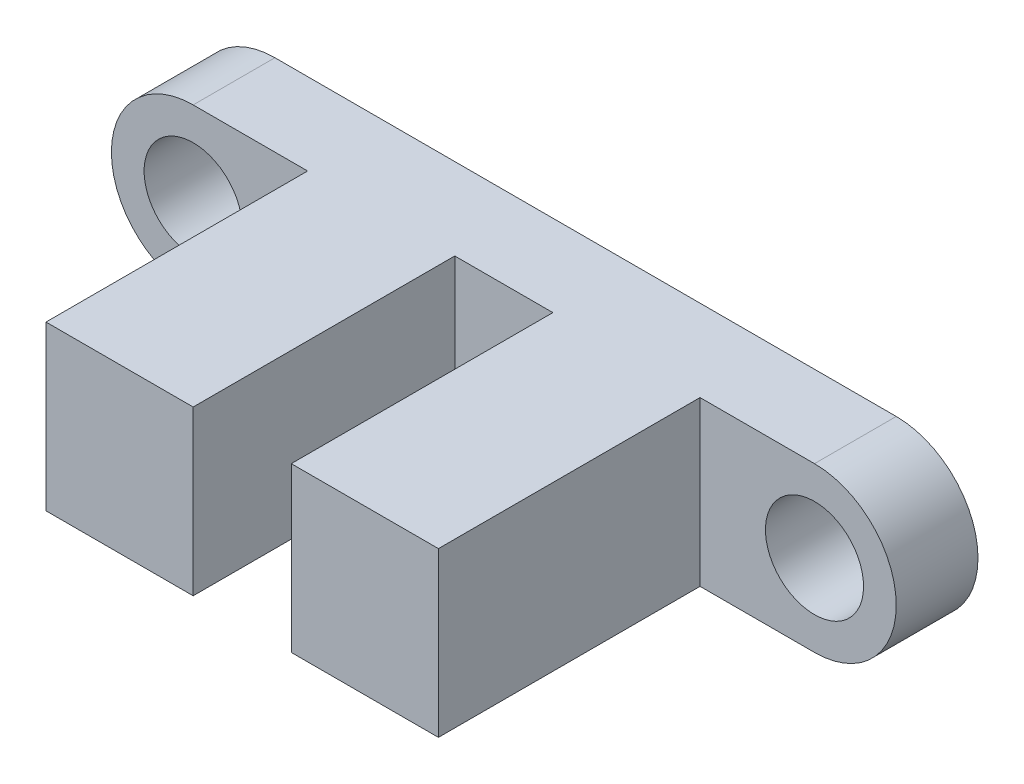
ISO-10303-21;
HEADER;
FILE_DESCRIPTION(('STEP AP214'),'2;1');
FILE_NAME('part.step','',(''),(''),'','','');
FILE_SCHEMA(('AUTOMOTIVE_DESIGN { 1 0 10303 214 1 1 1 1 }'));
ENDSEC;
DATA;
#1=APPLICATION_CONTEXT('core data for automotive mechanical design processes');
#2=APPLICATION_PROTOCOL_DEFINITION('international standard','automotive_design',2000,#1);
#3=PRODUCT_CONTEXT('',#1,'mechanical');
#4=PRODUCT('Part','Part','',(#3));
#5=PRODUCT_RELATED_PRODUCT_CATEGORY('part','',(#4));
#6=PRODUCT_DEFINITION_FORMATION('','',#4);
#7=PRODUCT_DEFINITION_CONTEXT('part definition',#1,'design');
#8=PRODUCT_DEFINITION('design','',#6,#7);
#9=PRODUCT_DEFINITION_SHAPE('','',#8);
#10=(LENGTH_UNIT() NAMED_UNIT(*) SI_UNIT(.MILLI.,.METRE.));
#11=(NAMED_UNIT(*) PLANE_ANGLE_UNIT() SI_UNIT($,.RADIAN.));
#12=(NAMED_UNIT(*) SI_UNIT($,.STERADIAN.) SOLID_ANGLE_UNIT());
#13=UNCERTAINTY_MEASURE_WITH_UNIT(LENGTH_MEASURE(1.E-05),#10,'distance_accuracy_value','');
#14=(GEOMETRIC_REPRESENTATION_CONTEXT(3) GLOBAL_UNCERTAINTY_ASSIGNED_CONTEXT((#13)) GLOBAL_UNIT_ASSIGNED_CONTEXT((#10,
#11,#12)) REPRESENTATION_CONTEXT('',''));
#15=CARTESIAN_POINT('',(0.,0.,0.));
#16=DIRECTION('',(0.,0.,1.));
#17=DIRECTION('',(1.,0.,0.));
#18=AXIS2_PLACEMENT_3D('',#15,#16,#17);
#19=CARTESIAN_POINT('',(0.,0.,2.5));
#20=DIRECTION('',(0.,0.,1.));
#21=DIRECTION('',(1.,0.,0.));
#22=AXIS2_PLACEMENT_3D('',#19,#20,#21);
#23=PLANE('',#22);
#24=DIRECTION('',(0.,1.,0.));
#25=VECTOR('',#24,1.);
#26=CARTESIAN_POINT('',(8.,2.5,2.5));
#27=LINE('',#26,#25);
#28=CARTESIAN_POINT('',(8.,-2.5,2.5));
#29=VERTEX_POINT('',#28);
#30=CARTESIAN_POINT('',(8.,2.5,2.5));
#31=VERTEX_POINT('',#30);
#32=EDGE_CURVE('E151',#29,#31,#27,.T.);
#33=ORIENTED_EDGE('',*,*,#32,.F.);
#34=DIRECTION('',(1.,0.,0.));
#35=VECTOR('',#34,1.);
#36=CARTESIAN_POINT('',(0.,-2.5,2.5));
#37=LINE('',#36,#35);
#38=CARTESIAN_POINT('',(11.,-2.5,2.5));
#39=VERTEX_POINT('',#38);
#40=EDGE_CURVE('E205',#29,#39,#37,.T.);
#41=ORIENTED_EDGE('',*,*,#40,.T.);
#42=DIRECTION('',(0.,-1.,0.));
#43=VECTOR('',#42,1.);
#44=CARTESIAN_POINT('',(11.,2.5,2.5));
#45=LINE('',#44,#43);
#46=CARTESIAN_POINT('',(11.,2.5,2.5));
#47=VERTEX_POINT('',#46);
#48=EDGE_CURVE('E174',#47,#39,#45,.T.);
#49=ORIENTED_EDGE('',*,*,#48,.F.);
#50=DIRECTION('',(-1.,0.,0.));
#51=VECTOR('',#50,1.);
#52=CARTESIAN_POINT('',(0.,2.5,2.5));
#53=LINE('',#52,#51);
#54=EDGE_CURVE('E64',#47,#31,#53,.T.);
#55=ORIENTED_EDGE('',*,*,#54,.T.);
#56=EDGE_LOOP('',(#33,#41,#49,#55));
#57=FACE_BOUND('',#56,.T.);
#58=ADVANCED_FACE('F41',(#57),#23,.T.);
#59=DIRECTION('',(0.,1.,0.));
#60=VECTOR('',#59,1.);
#61=CARTESIAN_POINT('',(15.5,2.5,2.5));
#62=LINE('',#61,#60);
#63=CARTESIAN_POINT('',(15.5,-2.5,2.5));
#64=VERTEX_POINT('',#63);
#65=CARTESIAN_POINT('',(15.5,2.5,2.5));
#66=VERTEX_POINT('',#65);
#67=EDGE_CURVE('E177',#64,#66,#62,.T.);
#68=ORIENTED_EDGE('',*,*,#67,.F.);
#69=CARTESIAN_POINT('',(19.,-2.5,2.5));
#70=VERTEX_POINT('',#69);
#71=EDGE_CURVE('E200',#64,#70,#37,.T.);
#72=ORIENTED_EDGE('',*,*,#71,.T.);
#73=CARTESIAN_POINT('',(19.,0.,2.5));
#74=DIRECTION('',(0.,0.,1.));
#75=DIRECTION('',(-1.,0.,0.));
#76=AXIS2_PLACEMENT_3D('',#73,#74,#75);
#77=CIRCLE('',#76,2.5);
#78=CARTESIAN_POINT('',(19.,2.5,2.5));
#79=VERTEX_POINT('',#78);
#80=EDGE_CURVE('E204',#70,#79,#77,.T.);
#81=ORIENTED_EDGE('',*,*,#80,.T.);
#82=EDGE_CURVE('E208',#79,#66,#53,.T.);
#83=ORIENTED_EDGE('',*,*,#82,.T.);
#84=EDGE_LOOP('',(#68,#72,#81,#83));
#85=FACE_BOUND('',#84,.T.);
#86=CARTESIAN_POINT('',(19.,0.,2.5));
#87=DIRECTION('',(0.,0.,1.));
#88=DIRECTION('',(1.,0.,0.));
#89=AXIS2_PLACEMENT_3D('',#86,#87,#88);
#90=CIRCLE('',#89,1.5);
#91=CARTESIAN_POINT('',(20.5,0.,2.5));
#92=VERTEX_POINT('',#91);
#93=EDGE_CURVE('E155',#92,#92,#90,.T.);
#94=ORIENTED_EDGE('',*,*,#93,.F.);
#95=EDGE_LOOP('',(#94));
#96=FACE_BOUND('',#95,.T.);
#97=ADVANCED_FACE('F258',(#85,#96),#23,.T.);
#98=DIRECTION('',(0.,-1.,0.));
#99=VECTOR('',#98,1.);
#100=CARTESIAN_POINT('',(3.5,2.5,2.5));
#101=LINE('',#100,#99);
#102=CARTESIAN_POINT('',(3.5,2.5,2.5));
#103=VERTEX_POINT('',#102);
#104=CARTESIAN_POINT('',(3.5,-2.5,2.5));
#105=VERTEX_POINT('',#104);
#106=EDGE_CURVE('E56',#103,#105,#101,.T.);
#107=ORIENTED_EDGE('',*,*,#106,.F.);
#108=CARTESIAN_POINT('',(0.,2.5,2.5));
#109=VERTEX_POINT('',#108);
#110=EDGE_CURVE('E207',#103,#109,#53,.T.);
#111=ORIENTED_EDGE('',*,*,#110,.T.);
#112=CARTESIAN_POINT('',(0.,0.,2.5));
#113=DIRECTION('',(0.,0.,1.));
#114=DIRECTION('',(1.,0.,0.));
#115=AXIS2_PLACEMENT_3D('',#112,#113,#114);
#116=CIRCLE('',#115,2.5);
#117=CARTESIAN_POINT('',(0.,-2.5,2.5));
#118=VERTEX_POINT('',#117);
#119=EDGE_CURVE('E197',#109,#118,#116,.T.);
#120=ORIENTED_EDGE('',*,*,#119,.T.);
#121=EDGE_CURVE('E202',#118,#105,#37,.T.);
#122=ORIENTED_EDGE('',*,*,#121,.T.);
#123=EDGE_LOOP('',(#107,#111,#120,#122));
#124=FACE_BOUND('',#123,.T.);
#125=CARTESIAN_POINT('',(0.,0.,2.5));
#126=DIRECTION('',(0.,0.,1.));
#127=DIRECTION('',(1.,0.,0.));
#128=AXIS2_PLACEMENT_3D('',#125,#126,#127);
#129=CIRCLE('',#128,1.5);
#130=CARTESIAN_POINT('',(1.5,0.,2.5));
#131=VERTEX_POINT('',#130);
#132=EDGE_CURVE('E191',#131,#131,#129,.T.);
#133=ORIENTED_EDGE('',*,*,#132,.F.);
#134=EDGE_LOOP('',(#133));
#135=FACE_BOUND('',#134,.T.);
#136=ADVANCED_FACE('F241',(#124,#135),#23,.T.);
#137=CARTESIAN_POINT('',(0.,0.,0.));
#138=DIRECTION('',(0.,0.,1.));
#139=DIRECTION('',(1.,0.,0.));
#140=AXIS2_PLACEMENT_3D('',#137,#138,#139);
#141=PLANE('',#140);
#142=CARTESIAN_POINT('',(0.,0.,0.));
#143=DIRECTION('',(0.,0.,1.));
#144=DIRECTION('',(1.,0.,0.));
#145=AXIS2_PLACEMENT_3D('',#142,#143,#144);
#146=CIRCLE('',#145,2.5);
#147=CARTESIAN_POINT('',(0.,2.5,0.));
#148=VERTEX_POINT('',#147);
#149=CARTESIAN_POINT('',(0.,-2.5,0.));
#150=VERTEX_POINT('',#149);
#151=EDGE_CURVE('E194',#148,#150,#146,.T.);
#152=ORIENTED_EDGE('',*,*,#151,.F.);
#153=DIRECTION('',(-1.,0.,0.));
#154=VECTOR('',#153,1.);
#155=CARTESIAN_POINT('',(0.,2.5,0.));
#156=LINE('',#155,#154);
#157=CARTESIAN_POINT('',(19.,2.5,0.));
#158=VERTEX_POINT('',#157);
#159=EDGE_CURVE('E201',#158,#148,#156,.T.);
#160=ORIENTED_EDGE('',*,*,#159,.F.);
#161=CARTESIAN_POINT('',(19.,0.,0.));
#162=DIRECTION('',(0.,0.,1.));
#163=DIRECTION('',(-1.,0.,0.));
#164=AXIS2_PLACEMENT_3D('',#161,#162,#163);
#165=CIRCLE('',#164,2.5);
#166=CARTESIAN_POINT('',(19.,-2.5,0.));
#167=VERTEX_POINT('',#166);
#168=EDGE_CURVE('E215',#167,#158,#165,.T.);
#169=ORIENTED_EDGE('',*,*,#168,.F.);
#170=DIRECTION('',(1.,0.,0.));
#171=VECTOR('',#170,1.);
#172=CARTESIAN_POINT('',(0.,-2.5,0.));
#173=LINE('',#172,#171);
#174=EDGE_CURVE('E213',#150,#167,#173,.T.);
#175=ORIENTED_EDGE('',*,*,#174,.F.);
#176=EDGE_LOOP('',(#152,#160,#169,#175));
#177=FACE_BOUND('',#176,.T.);
#178=CARTESIAN_POINT('',(0.,0.,0.));
#179=DIRECTION('',(0.,0.,1.));
#180=DIRECTION('',(1.,0.,0.));
#181=AXIS2_PLACEMENT_3D('',#178,#179,#180);
#182=CIRCLE('',#181,1.5);
#183=CARTESIAN_POINT('',(1.5,0.,0.));
#184=VERTEX_POINT('',#183);
#185=EDGE_CURVE('E189',#184,#184,#182,.T.);
#186=ORIENTED_EDGE('',*,*,#185,.T.);
#187=EDGE_LOOP('',(#186));
#188=FACE_BOUND('',#187,.T.);
#189=CARTESIAN_POINT('',(19.,0.,0.));
#190=DIRECTION('',(0.,0.,1.));
#191=DIRECTION('',(1.,0.,0.));
#192=AXIS2_PLACEMENT_3D('',#189,#190,#191);
#193=CIRCLE('',#192,1.5);
#194=CARTESIAN_POINT('',(20.5,0.,0.));
#195=VERTEX_POINT('',#194);
#196=EDGE_CURVE('E152',#195,#195,#193,.T.);
#197=ORIENTED_EDGE('',*,*,#196,.T.);
#198=EDGE_LOOP('',(#197));
#199=FACE_BOUND('',#198,.T.);
#200=ADVANCED_FACE('F234',(#177,#188,#199),#141,.F.);
#201=CARTESIAN_POINT('',(0.,0.,2.5));
#202=DIRECTION('',(0.,0.,-1.));
#203=DIRECTION('',(-1.,0.,0.));
#204=AXIS2_PLACEMENT_3D('',#201,#202,#203);
#205=CYLINDRICAL_SURFACE('',#204,2.5);
#206=ORIENTED_EDGE('',*,*,#151,.T.);
#207=DIRECTION('',(0.,0.,-1.));
#208=VECTOR('',#207,1.);
#209=CARTESIAN_POINT('',(0.,-2.5,2.5));
#210=LINE('',#209,#208);
#211=EDGE_CURVE('E11',#118,#150,#210,.T.);
#212=ORIENTED_EDGE('',*,*,#211,.F.);
#213=ORIENTED_EDGE('',*,*,#119,.F.);
#214=DIRECTION('',(0.,0.,-1.));
#215=VECTOR('',#214,1.);
#216=CARTESIAN_POINT('',(0.,2.5,2.5));
#217=LINE('',#216,#215);
#218=EDGE_CURVE('E210',#109,#148,#217,.T.);
#219=ORIENTED_EDGE('',*,*,#218,.T.);
#220=EDGE_LOOP('',(#206,#212,#213,#219));
#221=FACE_BOUND('',#220,.T.);
#222=ADVANCED_FACE('F43',(#221),#205,.T.);
#223=CARTESIAN_POINT('',(0.,-2.5,2.5));
#224=DIRECTION('',(0.,1.,0.));
#225=DIRECTION('',(0.,0.,1.));
#226=AXIS2_PLACEMENT_3D('',#223,#224,#225);
#227=PLANE('',#226);
#228=ORIENTED_EDGE('',*,*,#174,.T.);
#229=DIRECTION('',(0.,0.,-1.));
#230=VECTOR('',#229,1.);
#231=CARTESIAN_POINT('',(19.,-2.5,2.5));
#232=LINE('',#231,#230);
#233=EDGE_CURVE('E49',#70,#167,#232,.T.);
#234=ORIENTED_EDGE('',*,*,#233,.F.);
#235=ORIENTED_EDGE('',*,*,#71,.F.);
#236=DIRECTION('',(0.,0.,-1.));
#237=VECTOR('',#236,1.);
#238=CARTESIAN_POINT('',(15.5,-2.5,10.5));
#239=LINE('',#238,#237);
#240=CARTESIAN_POINT('',(15.5,-2.5,10.5));
#241=VERTEX_POINT('',#240);
#242=EDGE_CURVE('E170',#241,#64,#239,.T.);
#243=ORIENTED_EDGE('',*,*,#242,.F.);
#244=DIRECTION('',(1.,0.,0.));
#245=VECTOR('',#244,1.);
#246=CARTESIAN_POINT('',(15.5,-2.5,10.5));
#247=LINE('',#246,#245);
#248=CARTESIAN_POINT('',(11.,-2.5,10.5));
#249=VERTEX_POINT('',#248);
#250=EDGE_CURVE('E173',#249,#241,#247,.T.);
#251=ORIENTED_EDGE('',*,*,#250,.F.);
#252=DIRECTION('',(0.,0.,-1.));
#253=VECTOR('',#252,1.);
#254=CARTESIAN_POINT('',(11.,-2.5,10.5));
#255=LINE('',#254,#253);
#256=EDGE_CURVE('E167',#249,#39,#255,.T.);
#257=ORIENTED_EDGE('',*,*,#256,.T.);
#258=ORIENTED_EDGE('',*,*,#40,.F.);
#259=DIRECTION('',(0.,0.,-1.));
#260=VECTOR('',#259,1.);
#261=CARTESIAN_POINT('',(8.,-2.5,10.5));
#262=LINE('',#261,#260);
#263=CARTESIAN_POINT('',(8.,-2.5,10.5));
#264=VERTEX_POINT('',#263);
#265=EDGE_CURVE('E248',#264,#29,#262,.T.);
#266=ORIENTED_EDGE('',*,*,#265,.F.);
#267=DIRECTION('',(1.,0.,0.));
#268=VECTOR('',#267,1.);
#269=CARTESIAN_POINT('',(8.,-2.5,10.5));
#270=LINE('',#269,#268);
#271=CARTESIAN_POINT('',(3.5,-2.5,10.5));
#272=VERTEX_POINT('',#271);
#273=EDGE_CURVE('E145',#272,#264,#270,.T.);
#274=ORIENTED_EDGE('',*,*,#273,.F.);
#275=DIRECTION('',(0.,0.,-1.));
#276=VECTOR('',#275,1.);
#277=CARTESIAN_POINT('',(3.5,-2.5,10.5));
#278=LINE('',#277,#276);
#279=EDGE_CURVE('E157',#272,#105,#278,.T.);
#280=ORIENTED_EDGE('',*,*,#279,.T.);
#281=ORIENTED_EDGE('',*,*,#121,.F.);
#282=ORIENTED_EDGE('',*,*,#211,.T.);
#283=EDGE_LOOP('',(#228,#234,#235,#243,#251,#257,#258,#266,#274,#280,#281,#282));
#284=FACE_BOUND('',#283,.T.);
#285=ADVANCED_FACE('F253',(#284),#227,.F.);
#286=CARTESIAN_POINT('',(19.,0.,2.5));
#287=DIRECTION('',(0.,0.,-1.));
#288=DIRECTION('',(-1.,0.,0.));
#289=AXIS2_PLACEMENT_3D('',#286,#287,#288);
#290=CYLINDRICAL_SURFACE('',#289,2.5);
#291=ORIENTED_EDGE('',*,*,#168,.T.);
#292=DIRECTION('',(0.,0.,-1.));
#293=VECTOR('',#292,1.);
#294=CARTESIAN_POINT('',(19.,2.5,2.5));
#295=LINE('',#294,#293);
#296=EDGE_CURVE('E220',#79,#158,#295,.T.);
#297=ORIENTED_EDGE('',*,*,#296,.F.);
#298=ORIENTED_EDGE('',*,*,#80,.F.);
#299=ORIENTED_EDGE('',*,*,#233,.T.);
#300=EDGE_LOOP('',(#291,#297,#298,#299));
#301=FACE_BOUND('',#300,.T.);
#302=ADVANCED_FACE('F227',(#301),#290,.T.);
#303=CARTESIAN_POINT('',(0.,2.5,2.5));
#304=DIRECTION('',(0.,-1.,0.));
#305=DIRECTION('',(0.,0.,-1.));
#306=AXIS2_PLACEMENT_3D('',#303,#304,#305);
#307=PLANE('',#306);
#308=ORIENTED_EDGE('',*,*,#159,.T.);
#309=ORIENTED_EDGE('',*,*,#218,.F.);
#310=ORIENTED_EDGE('',*,*,#110,.F.);
#311=DIRECTION('',(0.,0.,-1.));
#312=VECTOR('',#311,1.);
#313=CARTESIAN_POINT('',(3.5,2.5,10.5));
#314=LINE('',#313,#312);
#315=CARTESIAN_POINT('',(3.5,2.5,10.5));
#316=VERTEX_POINT('',#315);
#317=EDGE_CURVE('E136',#316,#103,#314,.T.);
#318=ORIENTED_EDGE('',*,*,#317,.F.);
#319=DIRECTION('',(-1.,0.,0.));
#320=VECTOR('',#319,1.);
#321=CARTESIAN_POINT('',(8.,2.5,10.5));
#322=LINE('',#321,#320);
#323=CARTESIAN_POINT('',(8.,2.5,10.5));
#324=VERTEX_POINT('',#323);
#325=EDGE_CURVE('E129',#324,#316,#322,.T.);
#326=ORIENTED_EDGE('',*,*,#325,.F.);
#327=DIRECTION('',(0.,0.,-1.));
#328=VECTOR('',#327,1.);
#329=CARTESIAN_POINT('',(8.,2.5,10.5));
#330=LINE('',#329,#328);
#331=EDGE_CURVE('E133',#324,#31,#330,.T.);
#332=ORIENTED_EDGE('',*,*,#331,.T.);
#333=ORIENTED_EDGE('',*,*,#54,.F.);
#334=DIRECTION('',(0.,0.,-1.));
#335=VECTOR('',#334,1.);
#336=CARTESIAN_POINT('',(11.,2.5,10.5));
#337=LINE('',#336,#335);
#338=CARTESIAN_POINT('',(11.,2.5,10.5));
#339=VERTEX_POINT('',#338);
#340=EDGE_CURVE('E164',#339,#47,#337,.T.);
#341=ORIENTED_EDGE('',*,*,#340,.F.);
#342=DIRECTION('',(-1.,0.,0.));
#343=VECTOR('',#342,1.);
#344=CARTESIAN_POINT('',(15.5,2.5,10.5));
#345=LINE('',#344,#343);
#346=CARTESIAN_POINT('',(15.5,2.5,10.5));
#347=VERTEX_POINT('',#346);
#348=EDGE_CURVE('E184',#347,#339,#345,.T.);
#349=ORIENTED_EDGE('',*,*,#348,.F.);
#350=DIRECTION('',(0.,0.,-1.));
#351=VECTOR('',#350,1.);
#352=CARTESIAN_POINT('',(15.5,2.5,10.5));
#353=LINE('',#352,#351);
#354=EDGE_CURVE('E161',#347,#66,#353,.T.);
#355=ORIENTED_EDGE('',*,*,#354,.T.);
#356=ORIENTED_EDGE('',*,*,#82,.F.);
#357=ORIENTED_EDGE('',*,*,#296,.T.);
#358=EDGE_LOOP('',(#308,#309,#310,#318,#326,#332,#333,#341,#349,#355,#356,#357));
#359=FACE_BOUND('',#358,.T.);
#360=ADVANCED_FACE('F131',(#359),#307,.F.);
#361=CARTESIAN_POINT('',(0.,0.,2.5));
#362=DIRECTION('',(0.,0.,-1.));
#363=DIRECTION('',(-1.,0.,0.));
#364=AXIS2_PLACEMENT_3D('',#361,#362,#363);
#365=CYLINDRICAL_SURFACE('',#364,1.5);
#366=ORIENTED_EDGE('',*,*,#132,.T.);
#367=EDGE_LOOP('',(#366));
#368=FACE_BOUND('',#367,.T.);
#369=ORIENTED_EDGE('',*,*,#185,.F.);
#370=EDGE_LOOP('',(#369));
#371=FACE_BOUND('',#370,.T.);
#372=ADVANCED_FACE('F290',(#368,#371),#365,.F.);
#373=CARTESIAN_POINT('',(19.,0.,2.5));
#374=DIRECTION('',(0.,0.,-1.));
#375=DIRECTION('',(-1.,0.,0.));
#376=AXIS2_PLACEMENT_3D('',#373,#374,#375);
#377=CYLINDRICAL_SURFACE('',#376,1.5);
#378=ORIENTED_EDGE('',*,*,#93,.T.);
#379=EDGE_LOOP('',(#378));
#380=FACE_BOUND('',#379,.T.);
#381=ORIENTED_EDGE('',*,*,#196,.F.);
#382=EDGE_LOOP('',(#381));
#383=FACE_BOUND('',#382,.T.);
#384=ADVANCED_FACE('F306',(#380,#383),#377,.F.);
#385=CARTESIAN_POINT('',(15.5,2.5,10.5));
#386=DIRECTION('',(-1.,0.,0.));
#387=DIRECTION('',(0.,0.,1.));
#388=AXIS2_PLACEMENT_3D('',#385,#386,#387);
#389=PLANE('',#388);
#390=ORIENTED_EDGE('',*,*,#67,.T.);
#391=ORIENTED_EDGE('',*,*,#354,.F.);
#392=DIRECTION('',(0.,1.,0.));
#393=VECTOR('',#392,1.);
#394=CARTESIAN_POINT('',(15.5,2.5,10.5));
#395=LINE('',#394,#393);
#396=EDGE_CURVE('E178',#241,#347,#395,.T.);
#397=ORIENTED_EDGE('',*,*,#396,.F.);
#398=ORIENTED_EDGE('',*,*,#242,.T.);
#399=EDGE_LOOP('',(#390,#391,#397,#398));
#400=FACE_BOUND('',#399,.T.);
#401=ADVANCED_FACE('F263',(#400),#389,.F.);
#402=CARTESIAN_POINT('',(11.,2.5,10.5));
#403=DIRECTION('',(1.,0.,0.));
#404=DIRECTION('',(0.,0.,-1.));
#405=AXIS2_PLACEMENT_3D('',#402,#403,#404);
#406=PLANE('',#405);
#407=ORIENTED_EDGE('',*,*,#48,.T.);
#408=ORIENTED_EDGE('',*,*,#256,.F.);
#409=DIRECTION('',(0.,-1.,0.));
#410=VECTOR('',#409,1.);
#411=CARTESIAN_POINT('',(11.,2.5,10.5));
#412=LINE('',#411,#410);
#413=EDGE_CURVE('E182',#339,#249,#412,.T.);
#414=ORIENTED_EDGE('',*,*,#413,.F.);
#415=ORIENTED_EDGE('',*,*,#340,.T.);
#416=EDGE_LOOP('',(#407,#408,#414,#415));
#417=FACE_BOUND('',#416,.T.);
#418=ADVANCED_FACE('F270',(#417),#406,.F.);
#419=CARTESIAN_POINT('',(0.,0.,10.5));
#420=DIRECTION('',(0.,0.,-1.));
#421=DIRECTION('',(-1.,0.,0.));
#422=AXIS2_PLACEMENT_3D('',#419,#420,#421);
#423=PLANE('',#422);
#424=ORIENTED_EDGE('',*,*,#396,.T.);
#425=ORIENTED_EDGE('',*,*,#348,.T.);
#426=ORIENTED_EDGE('',*,*,#413,.T.);
#427=ORIENTED_EDGE('',*,*,#250,.T.);
#428=EDGE_LOOP('',(#424,#425,#426,#427));
#429=FACE_BOUND('',#428,.T.);
#430=ADVANCED_FACE('F266',(#429),#423,.F.);
#431=CARTESIAN_POINT('',(8.,2.5,10.5));
#432=DIRECTION('',(-1.,0.,0.));
#433=DIRECTION('',(0.,-1.,0.));
#434=AXIS2_PLACEMENT_3D('',#431,#432,#433);
#435=PLANE('',#434);
#436=ORIENTED_EDGE('',*,*,#32,.T.);
#437=ORIENTED_EDGE('',*,*,#331,.F.);
#438=DIRECTION('',(0.,1.,0.));
#439=VECTOR('',#438,1.);
#440=CARTESIAN_POINT('',(8.,2.5,10.5));
#441=LINE('',#440,#439);
#442=EDGE_CURVE('E140',#264,#324,#441,.T.);
#443=ORIENTED_EDGE('',*,*,#442,.F.);
#444=ORIENTED_EDGE('',*,*,#265,.T.);
#445=EDGE_LOOP('',(#436,#437,#443,#444));
#446=FACE_BOUND('',#445,.T.);
#447=ADVANCED_FACE('F150',(#446),#435,.F.);
#448=CARTESIAN_POINT('',(3.5,2.5,10.5));
#449=DIRECTION('',(1.,0.,0.));
#450=DIRECTION('',(0.,0.,-1.));
#451=AXIS2_PLACEMENT_3D('',#448,#449,#450);
#452=PLANE('',#451);
#453=ORIENTED_EDGE('',*,*,#106,.T.);
#454=ORIENTED_EDGE('',*,*,#279,.F.);
#455=DIRECTION('',(0.,-1.,0.));
#456=VECTOR('',#455,1.);
#457=CARTESIAN_POINT('',(3.5,2.5,10.5));
#458=LINE('',#457,#456);
#459=EDGE_CURVE('E139',#316,#272,#458,.T.);
#460=ORIENTED_EDGE('',*,*,#459,.F.);
#461=ORIENTED_EDGE('',*,*,#317,.T.);
#462=EDGE_LOOP('',(#453,#454,#460,#461));
#463=FACE_BOUND('',#462,.T.);
#464=ADVANCED_FACE('F244',(#463),#452,.F.);
#465=CARTESIAN_POINT('',(0.,0.,10.5));
#466=DIRECTION('',(0.,0.,-1.));
#467=DIRECTION('',(-1.,0.,0.));
#468=AXIS2_PLACEMENT_3D('',#465,#466,#467);
#469=PLANE('',#468);
#470=ORIENTED_EDGE('',*,*,#442,.T.);
#471=ORIENTED_EDGE('',*,*,#325,.T.);
#472=ORIENTED_EDGE('',*,*,#459,.T.);
#473=ORIENTED_EDGE('',*,*,#273,.T.);
#474=EDGE_LOOP('',(#470,#471,#472,#473));
#475=FACE_BOUND('',#474,.T.);
#476=ADVANCED_FACE('F143',(#475),#469,.F.);
#477=CLOSED_SHELL('',(#58,#97,#136,#200,#222,#285,#302,#360,#372,#384,#401,#418,#430,#447,#464,#476));
#478=MANIFOLD_SOLID_BREP('B2',#477);
#479=ADVANCED_BREP_SHAPE_REPRESENTATION('',(#18,#478),#14);
#480=SHAPE_DEFINITION_REPRESENTATION(#9,#479);
ENDSEC;
END-ISO-10303-21;
